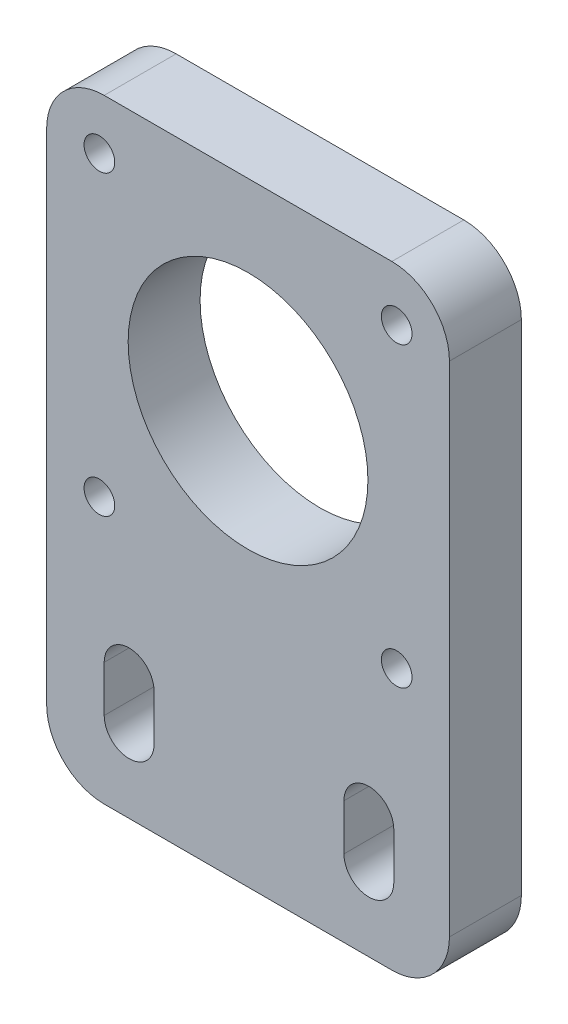
ISO-10303-21;
HEADER;
FILE_DESCRIPTION(('STEP AP214'),'2;1');
FILE_NAME('part.step','',(''),(''),'','','');
FILE_SCHEMA(('AUTOMOTIVE_DESIGN { 1 0 10303 214 1 1 1 1 }'));
ENDSEC;
DATA;
#1=APPLICATION_CONTEXT('core data for automotive mechanical design processes');
#2=APPLICATION_PROTOCOL_DEFINITION('international standard','automotive_design',2000,#1);
#3=PRODUCT_CONTEXT('',#1,'mechanical');
#4=PRODUCT('Part','Part','',(#3));
#5=PRODUCT_RELATED_PRODUCT_CATEGORY('part','',(#4));
#6=PRODUCT_DEFINITION_FORMATION('','',#4);
#7=PRODUCT_DEFINITION_CONTEXT('part definition',#1,'design');
#8=PRODUCT_DEFINITION('design','',#6,#7);
#9=PRODUCT_DEFINITION_SHAPE('','',#8);
#10=(LENGTH_UNIT() NAMED_UNIT(*) SI_UNIT(.MILLI.,.METRE.));
#11=(NAMED_UNIT(*) PLANE_ANGLE_UNIT() SI_UNIT($,.RADIAN.));
#12=(NAMED_UNIT(*) SI_UNIT($,.STERADIAN.) SOLID_ANGLE_UNIT());
#13=UNCERTAINTY_MEASURE_WITH_UNIT(LENGTH_MEASURE(1.E-05),#10,'distance_accuracy_value','');
#14=(GEOMETRIC_REPRESENTATION_CONTEXT(3) GLOBAL_UNCERTAINTY_ASSIGNED_CONTEXT((#13)) GLOBAL_UNIT_ASSIGNED_CONTEXT((#10,
#11,#12)) REPRESENTATION_CONTEXT('',''));
#15=CARTESIAN_POINT('',(0.,0.,0.));
#16=DIRECTION('',(0.,0.,1.));
#17=DIRECTION('',(1.,0.,0.));
#18=AXIS2_PLACEMENT_3D('',#15,#16,#17);
#19=CARTESIAN_POINT('',(-11.5945945945946,-19.4054054054054,-7.5));
#20=DIRECTION('',(0.,0.,1.));
#21=DIRECTION('',(1.,0.,0.));
#22=AXIS2_PLACEMENT_3D('',#19,#20,#21);
#23=CYLINDRICAL_SURFACE('',#22,6.);
#24=CARTESIAN_POINT('',(-11.5945945945946,-19.4054054054054,0.));
#25=DIRECTION('',(0.,0.,1.));
#26=DIRECTION('',(1.,0.,0.));
#27=AXIS2_PLACEMENT_3D('',#24,#25,#26);
#28=CIRCLE('',#27,6.);
#29=CARTESIAN_POINT('',(-17.5945945945946,-19.4054054054054,0.));
#30=VERTEX_POINT('',#29);
#31=CARTESIAN_POINT('',(-11.5945945945946,-25.4054054054054,0.));
#32=VERTEX_POINT('',#31);
#33=EDGE_CURVE('E242',#30,#32,#28,.T.);
#34=ORIENTED_EDGE('',*,*,#33,.F.);
#35=DIRECTION('',(0.,0.,1.));
#36=VECTOR('',#35,1.);
#37=CARTESIAN_POINT('',(-17.5945945945946,-19.4054054054054,-7.5));
#38=LINE('',#37,#36);
#39=CARTESIAN_POINT('',(-17.5945945945946,-19.4054054054054,-7.5));
#40=VERTEX_POINT('',#39);
#41=EDGE_CURVE('E11',#40,#30,#38,.T.);
#42=ORIENTED_EDGE('',*,*,#41,.F.);
#43=CARTESIAN_POINT('',(-11.5945945945946,-19.4054054054054,-7.5));
#44=DIRECTION('',(0.,0.,1.));
#45=DIRECTION('',(1.,0.,0.));
#46=AXIS2_PLACEMENT_3D('',#43,#44,#45);
#47=CIRCLE('',#46,6.);
#48=CARTESIAN_POINT('',(-11.5945945945946,-25.4054054054054,-7.5));
#49=VERTEX_POINT('',#48);
#50=EDGE_CURVE('E245',#40,#49,#47,.T.);
#51=ORIENTED_EDGE('',*,*,#50,.T.);
#52=DIRECTION('',(0.,0.,1.));
#53=VECTOR('',#52,1.);
#54=CARTESIAN_POINT('',(-11.5945945945946,-25.4054054054054,-7.5));
#55=LINE('',#54,#53);
#56=EDGE_CURVE('E36',#49,#32,#55,.T.);
#57=ORIENTED_EDGE('',*,*,#56,.T.);
#58=EDGE_LOOP('',(#34,#42,#51,#57));
#59=FACE_BOUND('',#58,.T.);
#60=ADVANCED_FACE('F33',(#59),#23,.T.);
#61=CARTESIAN_POINT('',(-17.5945945945946,32.5945945945946,-7.5));
#62=DIRECTION('',(-1.,0.,0.));
#63=DIRECTION('',(0.,0.,1.));
#64=AXIS2_PLACEMENT_3D('',#61,#62,#63);
#65=PLANE('',#64);
#66=DIRECTION('',(0.,-1.,0.));
#67=VECTOR('',#66,1.);
#68=CARTESIAN_POINT('',(-17.5945945945946,32.5945945945946,0.));
#69=LINE('',#68,#67);
#70=CARTESIAN_POINT('',(-17.5945945945946,32.5945945945946,0.));
#71=VERTEX_POINT('',#70);
#72=EDGE_CURVE('E249',#71,#30,#69,.T.);
#73=ORIENTED_EDGE('',*,*,#72,.F.);
#74=DIRECTION('',(0.,0.,1.));
#75=VECTOR('',#74,1.);
#76=CARTESIAN_POINT('',(-17.5945945945946,32.5945945945946,-7.5));
#77=LINE('',#76,#75);
#78=CARTESIAN_POINT('',(-17.5945945945946,32.5945945945946,-7.5));
#79=VERTEX_POINT('',#78);
#80=EDGE_CURVE('E41',#79,#71,#77,.T.);
#81=ORIENTED_EDGE('',*,*,#80,.F.);
#82=DIRECTION('',(0.,-1.,0.));
#83=VECTOR('',#82,1.);
#84=CARTESIAN_POINT('',(-17.5945945945946,32.5945945945946,-7.5));
#85=LINE('',#84,#83);
#86=EDGE_CURVE('E267',#79,#40,#85,.T.);
#87=ORIENTED_EDGE('',*,*,#86,.T.);
#88=ORIENTED_EDGE('',*,*,#41,.T.);
#89=EDGE_LOOP('',(#73,#81,#87,#88));
#90=FACE_BOUND('',#89,.T.);
#91=ADVANCED_FACE('F314',(#90),#65,.T.);
#92=CARTESIAN_POINT('',(-11.5945945945946,32.5945945945946,-7.5));
#93=DIRECTION('',(0.,0.,1.));
#94=DIRECTION('',(1.,0.,0.));
#95=AXIS2_PLACEMENT_3D('',#92,#93,#94);
#96=CYLINDRICAL_SURFACE('',#95,6.);
#97=CARTESIAN_POINT('',(-11.5945945945946,32.5945945945946,0.));
#98=DIRECTION('',(0.,0.,1.));
#99=DIRECTION('',(-1.,0.,0.));
#100=AXIS2_PLACEMENT_3D('',#97,#98,#99);
#101=CIRCLE('',#100,6.);
#102=CARTESIAN_POINT('',(-11.5945945945946,38.5945945945946,0.));
#103=VERTEX_POINT('',#102);
#104=EDGE_CURVE('E287',#103,#71,#101,.T.);
#105=ORIENTED_EDGE('',*,*,#104,.F.);
#106=DIRECTION('',(0.,0.,1.));
#107=VECTOR('',#106,1.);
#108=CARTESIAN_POINT('',(-11.5945945945946,38.5945945945946,-7.5));
#109=LINE('',#108,#107);
#110=CARTESIAN_POINT('',(-11.5945945945946,38.5945945945946,-7.5));
#111=VERTEX_POINT('',#110);
#112=EDGE_CURVE('E293',#111,#103,#109,.T.);
#113=ORIENTED_EDGE('',*,*,#112,.F.);
#114=CARTESIAN_POINT('',(-11.5945945945946,32.5945945945946,-7.5));
#115=DIRECTION('',(0.,0.,1.));
#116=DIRECTION('',(-1.,0.,0.));
#117=AXIS2_PLACEMENT_3D('',#114,#115,#116);
#118=CIRCLE('',#117,6.);
#119=EDGE_CURVE('E264',#111,#79,#118,.T.);
#120=ORIENTED_EDGE('',*,*,#119,.T.);
#121=ORIENTED_EDGE('',*,*,#80,.T.);
#122=EDGE_LOOP('',(#105,#113,#120,#121));
#123=FACE_BOUND('',#122,.T.);
#124=ADVANCED_FACE('F334',(#123),#96,.T.);
#125=CARTESIAN_POINT('',(-11.5945945945946,38.5945945945946,-7.5));
#126=DIRECTION('',(0.,1.,0.));
#127=DIRECTION('',(0.,0.,1.));
#128=AXIS2_PLACEMENT_3D('',#125,#126,#127);
#129=PLANE('',#128);
#130=DIRECTION('',(-1.,0.,0.));
#131=VECTOR('',#130,1.);
#132=CARTESIAN_POINT('',(-11.5945945945946,38.5945945945946,0.));
#133=LINE('',#132,#131);
#134=CARTESIAN_POINT('',(18.4054054054053,38.5945945945946,0.));
#135=VERTEX_POINT('',#134);
#136=EDGE_CURVE('E284',#135,#103,#133,.T.);
#137=ORIENTED_EDGE('',*,*,#136,.F.);
#138=DIRECTION('',(0.,0.,1.));
#139=VECTOR('',#138,1.);
#140=CARTESIAN_POINT('',(18.4054054054053,38.5945945945946,-7.5));
#141=LINE('',#140,#139);
#142=CARTESIAN_POINT('',(18.4054054054053,38.5945945945946,-7.5));
#143=VERTEX_POINT('',#142);
#144=EDGE_CURVE('E295',#143,#135,#141,.T.);
#145=ORIENTED_EDGE('',*,*,#144,.F.);
#146=DIRECTION('',(-1.,0.,0.));
#147=VECTOR('',#146,1.);
#148=CARTESIAN_POINT('',(-11.5945945945946,38.5945945945946,-7.5));
#149=LINE('',#148,#147);
#150=EDGE_CURVE('E261',#143,#111,#149,.T.);
#151=ORIENTED_EDGE('',*,*,#150,.T.);
#152=ORIENTED_EDGE('',*,*,#112,.T.);
#153=EDGE_LOOP('',(#137,#145,#151,#152));
#154=FACE_BOUND('',#153,.T.);
#155=ADVANCED_FACE('F332',(#154),#129,.T.);
#156=CARTESIAN_POINT('',(18.4054054054054,32.5945945945946,-7.5));
#157=DIRECTION('',(0.,0.,1.));
#158=DIRECTION('',(1.,0.,0.));
#159=AXIS2_PLACEMENT_3D('',#156,#157,#158);
#160=CYLINDRICAL_SURFACE('',#159,6.);
#161=CARTESIAN_POINT('',(18.4054054054054,32.5945945945946,0.));
#162=DIRECTION('',(0.,0.,1.));
#163=DIRECTION('',(1.,0.,0.));
#164=AXIS2_PLACEMENT_3D('',#161,#162,#163);
#165=CIRCLE('',#164,6.);
#166=CARTESIAN_POINT('',(24.4054054054054,32.5945945945946,0.));
#167=VERTEX_POINT('',#166);
#168=EDGE_CURVE('E281',#167,#135,#165,.T.);
#169=ORIENTED_EDGE('',*,*,#168,.F.);
#170=DIRECTION('',(0.,0.,1.));
#171=VECTOR('',#170,1.);
#172=CARTESIAN_POINT('',(24.4054054054054,32.5945945945946,-7.5));
#173=LINE('',#172,#171);
#174=CARTESIAN_POINT('',(24.4054054054054,32.5945945945946,-7.5));
#175=VERTEX_POINT('',#174);
#176=EDGE_CURVE('E297',#175,#167,#173,.T.);
#177=ORIENTED_EDGE('',*,*,#176,.F.);
#178=CARTESIAN_POINT('',(18.4054054054054,32.5945945945946,-7.5));
#179=DIRECTION('',(0.,0.,1.));
#180=DIRECTION('',(1.,0.,0.));
#181=AXIS2_PLACEMENT_3D('',#178,#179,#180);
#182=CIRCLE('',#181,6.);
#183=EDGE_CURVE('E258',#175,#143,#182,.T.);
#184=ORIENTED_EDGE('',*,*,#183,.T.);
#185=ORIENTED_EDGE('',*,*,#144,.T.);
#186=EDGE_LOOP('',(#169,#177,#184,#185));
#187=FACE_BOUND('',#186,.T.);
#188=ADVANCED_FACE('F328',(#187),#160,.T.);
#189=CARTESIAN_POINT('',(24.4054054054054,32.5945945945946,-7.5));
#190=DIRECTION('',(1.,0.,0.));
#191=DIRECTION('',(0.,1.,0.));
#192=AXIS2_PLACEMENT_3D('',#189,#190,#191);
#193=PLANE('',#192);
#194=DIRECTION('',(0.,1.,0.));
#195=VECTOR('',#194,1.);
#196=CARTESIAN_POINT('',(24.4054054054054,32.5945945945946,0.));
#197=LINE('',#196,#195);
#198=CARTESIAN_POINT('',(24.4054054054054,-19.4054054054054,0.));
#199=VERTEX_POINT('',#198);
#200=EDGE_CURVE('E278',#199,#167,#197,.T.);
#201=ORIENTED_EDGE('',*,*,#200,.F.);
#202=DIRECTION('',(0.,0.,1.));
#203=VECTOR('',#202,1.);
#204=CARTESIAN_POINT('',(24.4054054054054,-19.4054054054054,-7.5));
#205=LINE('',#204,#203);
#206=CARTESIAN_POINT('',(24.4054054054054,-19.4054054054054,-7.5));
#207=VERTEX_POINT('',#206);
#208=EDGE_CURVE('E299',#207,#199,#205,.T.);
#209=ORIENTED_EDGE('',*,*,#208,.F.);
#210=DIRECTION('',(0.,1.,0.));
#211=VECTOR('',#210,1.);
#212=CARTESIAN_POINT('',(24.4054054054054,32.5945945945946,-7.5));
#213=LINE('',#212,#211);
#214=EDGE_CURVE('E255',#207,#175,#213,.T.);
#215=ORIENTED_EDGE('',*,*,#214,.T.);
#216=ORIENTED_EDGE('',*,*,#176,.T.);
#217=EDGE_LOOP('',(#201,#209,#215,#216));
#218=FACE_BOUND('',#217,.T.);
#219=ADVANCED_FACE('F326',(#218),#193,.T.);
#220=CARTESIAN_POINT('',(18.4054054054054,-19.4054054054054,-7.5));
#221=DIRECTION('',(0.,0.,1.));
#222=DIRECTION('',(1.,0.,0.));
#223=AXIS2_PLACEMENT_3D('',#220,#221,#222);
#224=CYLINDRICAL_SURFACE('',#223,6.);
#225=CARTESIAN_POINT('',(18.4054054054054,-19.4054054054054,0.));
#226=DIRECTION('',(0.,0.,1.));
#227=DIRECTION('',(1.,0.,0.));
#228=AXIS2_PLACEMENT_3D('',#225,#226,#227);
#229=CIRCLE('',#228,6.);
#230=CARTESIAN_POINT('',(18.4054054054054,-25.4054054054054,0.));
#231=VERTEX_POINT('',#230);
#232=EDGE_CURVE('E275',#231,#199,#229,.T.);
#233=ORIENTED_EDGE('',*,*,#232,.F.);
#234=DIRECTION('',(0.,0.,1.));
#235=VECTOR('',#234,1.);
#236=CARTESIAN_POINT('',(18.4054054054054,-25.4054054054054,-7.5));
#237=LINE('',#236,#235);
#238=CARTESIAN_POINT('',(18.4054054054054,-25.4054054054054,-7.5));
#239=VERTEX_POINT('',#238);
#240=EDGE_CURVE('E300',#239,#231,#237,.T.);
#241=ORIENTED_EDGE('',*,*,#240,.F.);
#242=CARTESIAN_POINT('',(18.4054054054054,-19.4054054054054,-7.5));
#243=DIRECTION('',(0.,0.,1.));
#244=DIRECTION('',(1.,0.,0.));
#245=AXIS2_PLACEMENT_3D('',#242,#243,#244);
#246=CIRCLE('',#245,6.);
#247=EDGE_CURVE('E252',#239,#207,#246,.T.);
#248=ORIENTED_EDGE('',*,*,#247,.T.);
#249=ORIENTED_EDGE('',*,*,#208,.T.);
#250=EDGE_LOOP('',(#233,#241,#248,#249));
#251=FACE_BOUND('',#250,.T.);
#252=ADVANCED_FACE('F322',(#251),#224,.T.);
#253=CARTESIAN_POINT('',(-11.5945945945946,-25.4054054054054,-7.5));
#254=DIRECTION('',(0.,-1.,0.));
#255=DIRECTION('',(0.,0.,-1.));
#256=AXIS2_PLACEMENT_3D('',#253,#254,#255);
#257=PLANE('',#256);
#258=DIRECTION('',(1.,0.,0.));
#259=VECTOR('',#258,1.);
#260=CARTESIAN_POINT('',(-11.5945945945946,-25.4054054054054,0.));
#261=LINE('',#260,#259);
#262=EDGE_CURVE('E272',#32,#231,#261,.T.);
#263=ORIENTED_EDGE('',*,*,#262,.F.);
#264=ORIENTED_EDGE('',*,*,#56,.F.);
#265=DIRECTION('',(1.,0.,0.));
#266=VECTOR('',#265,1.);
#267=CARTESIAN_POINT('',(-11.5945945945946,-25.4054054054054,-7.5));
#268=LINE('',#267,#266);
#269=EDGE_CURVE('E248',#49,#239,#268,.T.);
#270=ORIENTED_EDGE('',*,*,#269,.T.);
#271=ORIENTED_EDGE('',*,*,#240,.T.);
#272=EDGE_LOOP('',(#263,#264,#270,#271));
#273=FACE_BOUND('',#272,.T.);
#274=ADVANCED_FACE('F308',(#273),#257,.T.);
#275=CARTESIAN_POINT('',(-11.5945945945946,-19.4054054054054,-7.5));
#276=DIRECTION('',(0.,0.,1.));
#277=DIRECTION('',(1.,0.,0.));
#278=AXIS2_PLACEMENT_3D('',#275,#276,#277);
#279=PLANE('',#278);
#280=DIRECTION('',(0.,1.,0.));
#281=VECTOR('',#280,1.);
#282=CARTESIAN_POINT('',(-6.39459459459461,-12.6054054054054,-7.5));
#283=LINE('',#282,#281);
#284=CARTESIAN_POINT('',(-6.39459459459461,-17.40540541,-7.5));
#285=VERTEX_POINT('',#284);
#286=CARTESIAN_POINT('',(-6.39459459459461,-12.6054054054054,-7.5));
#287=VERTEX_POINT('',#286);
#288=EDGE_CURVE('E154',#285,#287,#283,.T.);
#289=ORIENTED_EDGE('',*,*,#288,.T.);
#290=CARTESIAN_POINT('',(-8.99459459459461,-12.6054054054054,-7.5));
#291=DIRECTION('',(0.,0.,1.));
#292=DIRECTION('',(1.,0.,0.));
#293=AXIS2_PLACEMENT_3D('',#290,#291,#292);
#294=CIRCLE('',#293,2.6);
#295=CARTESIAN_POINT('',(-11.5945945945946,-12.6054054054054,-7.5));
#296=VERTEX_POINT('',#295);
#297=EDGE_CURVE('E148',#287,#296,#294,.T.);
#298=ORIENTED_EDGE('',*,*,#297,.T.);
#299=DIRECTION('',(0.,-1.,0.));
#300=VECTOR('',#299,1.);
#301=CARTESIAN_POINT('',(-11.5945945945946,-12.6054054054054,-7.5));
#302=LINE('',#301,#300);
#303=CARTESIAN_POINT('',(-11.5945945945946,-17.40540541,-7.5));
#304=VERTEX_POINT('',#303);
#305=EDGE_CURVE('E157',#296,#304,#302,.T.);
#306=ORIENTED_EDGE('',*,*,#305,.T.);
#307=CARTESIAN_POINT('',(-8.99459459459461,-17.40540541,-7.5));
#308=DIRECTION('',(0.,0.,1.));
#309=DIRECTION('',(1.,0.,0.));
#310=AXIS2_PLACEMENT_3D('',#307,#308,#309);
#311=CIRCLE('',#310,2.6);
#312=EDGE_CURVE('E49',#304,#285,#311,.T.);
#313=ORIENTED_EDGE('',*,*,#312,.T.);
#314=EDGE_LOOP('',(#289,#298,#306,#313));
#315=FACE_BOUND('',#314,.T.);
#316=DIRECTION('',(0.,1.,0.));
#317=VECTOR('',#316,1.);
#318=CARTESIAN_POINT('',(18.6054054054054,-12.6054054054054,-7.5));
#319=LINE('',#318,#317);
#320=CARTESIAN_POINT('',(18.6054054054054,-17.40540541,-7.5));
#321=VERTEX_POINT('',#320);
#322=CARTESIAN_POINT('',(18.6054054054054,-12.6054054054054,-7.5));
#323=VERTEX_POINT('',#322);
#324=EDGE_CURVE('E193',#321,#323,#319,.T.);
#325=ORIENTED_EDGE('',*,*,#324,.T.);
#326=CARTESIAN_POINT('',(16.0054054054054,-12.6054054054054,-7.5));
#327=DIRECTION('',(0.,0.,1.));
#328=DIRECTION('',(1.,0.,0.));
#329=AXIS2_PLACEMENT_3D('',#326,#327,#328);
#330=CIRCLE('',#329,2.6);
#331=CARTESIAN_POINT('',(13.4054054054054,-12.6054054054054,-7.5));
#332=VERTEX_POINT('',#331);
#333=EDGE_CURVE('E183',#323,#332,#330,.T.);
#334=ORIENTED_EDGE('',*,*,#333,.T.);
#335=DIRECTION('',(0.,-1.,0.));
#336=VECTOR('',#335,1.);
#337=CARTESIAN_POINT('',(13.4054054054054,-12.6054054054054,-7.5));
#338=LINE('',#337,#336);
#339=CARTESIAN_POINT('',(13.4054054054054,-17.40540541,-7.5));
#340=VERTEX_POINT('',#339);
#341=EDGE_CURVE('E186',#332,#340,#338,.T.);
#342=ORIENTED_EDGE('',*,*,#341,.T.);
#343=CARTESIAN_POINT('',(16.0054054054054,-17.40540541,-7.5));
#344=DIRECTION('',(0.,0.,1.));
#345=DIRECTION('',(1.,0.,0.));
#346=AXIS2_PLACEMENT_3D('',#343,#344,#345);
#347=CIRCLE('',#346,2.6);
#348=EDGE_CURVE('E190',#340,#321,#347,.T.);
#349=ORIENTED_EDGE('',*,*,#348,.T.);
#350=EDGE_LOOP('',(#325,#334,#342,#349));
#351=FACE_BOUND('',#350,.T.);
#352=CARTESIAN_POINT('',(-12.0945945945946,2.09459459459461,-7.5));
#353=DIRECTION('',(0.,0.,1.));
#354=DIRECTION('',(1.,0.,0.));
#355=AXIS2_PLACEMENT_3D('',#352,#353,#354);
#356=CIRCLE('',#355,1.6);
#357=CARTESIAN_POINT('',(-10.4945945945946,2.09459459459461,-7.5));
#358=VERTEX_POINT('',#357);
#359=EDGE_CURVE('E215',#358,#358,#356,.T.);
#360=ORIENTED_EDGE('',*,*,#359,.T.);
#361=EDGE_LOOP('',(#360));
#362=FACE_BOUND('',#361,.T.);
#363=CARTESIAN_POINT('',(18.9054054054054,2.09459459459461,-7.5));
#364=DIRECTION('',(0.,0.,1.));
#365=DIRECTION('',(1.,0.,0.));
#366=AXIS2_PLACEMENT_3D('',#363,#364,#365);
#367=CIRCLE('',#366,1.6);
#368=CARTESIAN_POINT('',(20.5054054054054,2.09459459459461,-7.5));
#369=VERTEX_POINT('',#368);
#370=EDGE_CURVE('E221',#369,#369,#367,.T.);
#371=ORIENTED_EDGE('',*,*,#370,.T.);
#372=EDGE_LOOP('',(#371));
#373=FACE_BOUND('',#372,.T.);
#374=CARTESIAN_POINT('',(18.9054054054054,33.0945945945946,-7.5));
#375=DIRECTION('',(0.,0.,1.));
#376=DIRECTION('',(1.,0.,0.));
#377=AXIS2_PLACEMENT_3D('',#374,#375,#376);
#378=CIRCLE('',#377,1.6);
#379=CARTESIAN_POINT('',(20.5054054054054,33.0945945945946,-7.5));
#380=VERTEX_POINT('',#379);
#381=EDGE_CURVE('E227',#380,#380,#378,.T.);
#382=ORIENTED_EDGE('',*,*,#381,.T.);
#383=EDGE_LOOP('',(#382));
#384=FACE_BOUND('',#383,.T.);
#385=CARTESIAN_POINT('',(-12.0945945945946,33.0945945945946,-7.5));
#386=DIRECTION('',(0.,0.,1.));
#387=DIRECTION('',(1.,0.,0.));
#388=AXIS2_PLACEMENT_3D('',#385,#386,#387);
#389=CIRCLE('',#388,1.6);
#390=CARTESIAN_POINT('',(-10.4945945945946,33.0945945945946,-7.5));
#391=VERTEX_POINT('',#390);
#392=EDGE_CURVE('E233',#391,#391,#389,.T.);
#393=ORIENTED_EDGE('',*,*,#392,.T.);
#394=EDGE_LOOP('',(#393));
#395=FACE_BOUND('',#394,.T.);
#396=CARTESIAN_POINT('',(3.40540540540538,17.5945945945946,-7.5));
#397=DIRECTION('',(0.,0.,1.));
#398=DIRECTION('',(1.,0.,0.));
#399=AXIS2_PLACEMENT_3D('',#396,#397,#398);
#400=CIRCLE('',#399,12.5);
#401=CARTESIAN_POINT('',(15.9054054054054,17.5945945945946,-7.5));
#402=VERTEX_POINT('',#401);
#403=EDGE_CURVE('E239',#402,#402,#400,.T.);
#404=ORIENTED_EDGE('',*,*,#403,.T.);
#405=EDGE_LOOP('',(#404));
#406=FACE_BOUND('',#405,.T.);
#407=ORIENTED_EDGE('',*,*,#50,.F.);
#408=ORIENTED_EDGE('',*,*,#86,.F.);
#409=ORIENTED_EDGE('',*,*,#119,.F.);
#410=ORIENTED_EDGE('',*,*,#150,.F.);
#411=ORIENTED_EDGE('',*,*,#183,.F.);
#412=ORIENTED_EDGE('',*,*,#214,.F.);
#413=ORIENTED_EDGE('',*,*,#247,.F.);
#414=ORIENTED_EDGE('',*,*,#269,.F.);
#415=EDGE_LOOP('',(#407,#408,#409,#410,#411,#412,#413,#414));
#416=FACE_BOUND('',#415,.T.);
#417=ADVANCED_FACE('F161',(#315,#351,#362,#373,#384,#395,#406,#416),#279,.F.);
#418=CARTESIAN_POINT('',(-11.5945945945946,-19.4054054054054,0.));
#419=DIRECTION('',(0.,0.,1.));
#420=DIRECTION('',(1.,0.,0.));
#421=AXIS2_PLACEMENT_3D('',#418,#419,#420);
#422=PLANE('',#421);
#423=CARTESIAN_POINT('',(-8.99459459459461,-12.6054054054054,0.));
#424=DIRECTION('',(0.,0.,1.));
#425=DIRECTION('',(1.,0.,0.));
#426=AXIS2_PLACEMENT_3D('',#423,#424,#425);
#427=CIRCLE('',#426,2.6);
#428=CARTESIAN_POINT('',(-6.39459459459461,-12.6054054054054,0.));
#429=VERTEX_POINT('',#428);
#430=CARTESIAN_POINT('',(-11.5945945945946,-12.6054054054054,0.));
#431=VERTEX_POINT('',#430);
#432=EDGE_CURVE('E57',#429,#431,#427,.T.);
#433=ORIENTED_EDGE('',*,*,#432,.F.);
#434=DIRECTION('',(0.,1.,0.));
#435=VECTOR('',#434,1.);
#436=CARTESIAN_POINT('',(-6.39459459459461,-12.6054054054054,0.));
#437=LINE('',#436,#435);
#438=CARTESIAN_POINT('',(-6.39459459459461,-17.40540541,0.));
#439=VERTEX_POINT('',#438);
#440=EDGE_CURVE('E164',#439,#429,#437,.T.);
#441=ORIENTED_EDGE('',*,*,#440,.F.);
#442=CARTESIAN_POINT('',(-8.99459459459461,-17.40540541,0.));
#443=DIRECTION('',(0.,0.,1.));
#444=DIRECTION('',(1.,0.,0.));
#445=AXIS2_PLACEMENT_3D('',#442,#443,#444);
#446=CIRCLE('',#445,2.6);
#447=CARTESIAN_POINT('',(-11.5945945945946,-17.40540541,0.));
#448=VERTEX_POINT('',#447);
#449=EDGE_CURVE('E167',#448,#439,#446,.T.);
#450=ORIENTED_EDGE('',*,*,#449,.F.);
#451=DIRECTION('',(0.,-1.,0.));
#452=VECTOR('',#451,1.);
#453=CARTESIAN_POINT('',(-11.5945945945946,-12.6054054054054,0.));
#454=LINE('',#453,#452);
#455=EDGE_CURVE('E173',#431,#448,#454,.T.);
#456=ORIENTED_EDGE('',*,*,#455,.F.);
#457=EDGE_LOOP('',(#433,#441,#450,#456));
#458=FACE_BOUND('',#457,.T.);
#459=CARTESIAN_POINT('',(16.0054054054054,-12.6054054054054,0.));
#460=DIRECTION('',(0.,0.,1.));
#461=DIRECTION('',(1.,0.,0.));
#462=AXIS2_PLACEMENT_3D('',#459,#460,#461);
#463=CIRCLE('',#462,2.6);
#464=CARTESIAN_POINT('',(18.6054054054054,-12.6054054054054,0.));
#465=VERTEX_POINT('',#464);
#466=CARTESIAN_POINT('',(13.4054054054054,-12.6054054054054,0.));
#467=VERTEX_POINT('',#466);
#468=EDGE_CURVE('E179',#465,#467,#463,.T.);
#469=ORIENTED_EDGE('',*,*,#468,.F.);
#470=DIRECTION('',(0.,1.,0.));
#471=VECTOR('',#470,1.);
#472=CARTESIAN_POINT('',(18.6054054054054,-12.6054054054054,0.));
#473=LINE('',#472,#471);
#474=CARTESIAN_POINT('',(18.6054054054054,-17.40540541,0.));
#475=VERTEX_POINT('',#474);
#476=EDGE_CURVE('E187',#475,#465,#473,.T.);
#477=ORIENTED_EDGE('',*,*,#476,.F.);
#478=CARTESIAN_POINT('',(16.0054054054054,-17.40540541,0.));
#479=DIRECTION('',(0.,0.,1.));
#480=DIRECTION('',(1.,0.,0.));
#481=AXIS2_PLACEMENT_3D('',#478,#479,#480);
#482=CIRCLE('',#481,2.6);
#483=CARTESIAN_POINT('',(13.4054054054054,-17.40540541,0.));
#484=VERTEX_POINT('',#483);
#485=EDGE_CURVE('E201',#484,#475,#482,.T.);
#486=ORIENTED_EDGE('',*,*,#485,.F.);
#487=DIRECTION('',(0.,-1.,0.));
#488=VECTOR('',#487,1.);
#489=CARTESIAN_POINT('',(13.4054054054054,-12.6054054054054,0.));
#490=LINE('',#489,#488);
#491=EDGE_CURVE('E198',#467,#484,#490,.T.);
#492=ORIENTED_EDGE('',*,*,#491,.F.);
#493=EDGE_LOOP('',(#469,#477,#486,#492));
#494=FACE_BOUND('',#493,.T.);
#495=CARTESIAN_POINT('',(-12.0945945945946,2.09459459459461,0.));
#496=DIRECTION('',(0.,0.,1.));
#497=DIRECTION('',(1.,0.,0.));
#498=AXIS2_PLACEMENT_3D('',#495,#496,#497);
#499=CIRCLE('',#498,1.6);
#500=CARTESIAN_POINT('',(-10.4945945945946,2.09459459459461,0.));
#501=VERTEX_POINT('',#500);
#502=EDGE_CURVE('E208',#501,#501,#499,.T.);
#503=ORIENTED_EDGE('',*,*,#502,.F.);
#504=EDGE_LOOP('',(#503));
#505=FACE_BOUND('',#504,.T.);
#506=CARTESIAN_POINT('',(18.9054054054054,2.09459459459461,0.));
#507=DIRECTION('',(0.,0.,1.));
#508=DIRECTION('',(1.,0.,0.));
#509=AXIS2_PLACEMENT_3D('',#506,#507,#508);
#510=CIRCLE('',#509,1.6);
#511=CARTESIAN_POINT('',(20.5054054054054,2.09459459459461,0.));
#512=VERTEX_POINT('',#511);
#513=EDGE_CURVE('E218',#512,#512,#510,.T.);
#514=ORIENTED_EDGE('',*,*,#513,.F.);
#515=EDGE_LOOP('',(#514));
#516=FACE_BOUND('',#515,.T.);
#517=CARTESIAN_POINT('',(18.9054054054054,33.0945945945946,0.));
#518=DIRECTION('',(0.,0.,1.));
#519=DIRECTION('',(1.,0.,0.));
#520=AXIS2_PLACEMENT_3D('',#517,#518,#519);
#521=CIRCLE('',#520,1.6);
#522=CARTESIAN_POINT('',(20.5054054054054,33.0945945945946,0.));
#523=VERTEX_POINT('',#522);
#524=EDGE_CURVE('E224',#523,#523,#521,.T.);
#525=ORIENTED_EDGE('',*,*,#524,.F.);
#526=EDGE_LOOP('',(#525));
#527=FACE_BOUND('',#526,.T.);
#528=CARTESIAN_POINT('',(-12.0945945945946,33.0945945945946,0.));
#529=DIRECTION('',(0.,0.,1.));
#530=DIRECTION('',(1.,0.,0.));
#531=AXIS2_PLACEMENT_3D('',#528,#529,#530);
#532=CIRCLE('',#531,1.6);
#533=CARTESIAN_POINT('',(-10.4945945945946,33.0945945945946,0.));
#534=VERTEX_POINT('',#533);
#535=EDGE_CURVE('E230',#534,#534,#532,.T.);
#536=ORIENTED_EDGE('',*,*,#535,.F.);
#537=EDGE_LOOP('',(#536));
#538=FACE_BOUND('',#537,.T.);
#539=CARTESIAN_POINT('',(3.40540540540538,17.5945945945946,0.));
#540=DIRECTION('',(0.,0.,1.));
#541=DIRECTION('',(1.,0.,0.));
#542=AXIS2_PLACEMENT_3D('',#539,#540,#541);
#543=CIRCLE('',#542,12.5);
#544=CARTESIAN_POINT('',(15.9054054054054,17.5945945945946,0.));
#545=VERTEX_POINT('',#544);
#546=EDGE_CURVE('E236',#545,#545,#543,.T.);
#547=ORIENTED_EDGE('',*,*,#546,.F.);
#548=EDGE_LOOP('',(#547));
#549=FACE_BOUND('',#548,.T.);
#550=ORIENTED_EDGE('',*,*,#33,.T.);
#551=ORIENTED_EDGE('',*,*,#262,.T.);
#552=ORIENTED_EDGE('',*,*,#232,.T.);
#553=ORIENTED_EDGE('',*,*,#200,.T.);
#554=ORIENTED_EDGE('',*,*,#168,.T.);
#555=ORIENTED_EDGE('',*,*,#136,.T.);
#556=ORIENTED_EDGE('',*,*,#104,.T.);
#557=ORIENTED_EDGE('',*,*,#72,.T.);
#558=EDGE_LOOP('',(#550,#551,#552,#553,#554,#555,#556,#557));
#559=FACE_BOUND('',#558,.T.);
#560=ADVANCED_FACE('F310',(#458,#494,#505,#516,#527,#538,#549,#559),#422,.T.);
#561=CARTESIAN_POINT('',(3.40540540540538,17.5945945945946,-7.5));
#562=DIRECTION('',(0.,0.,1.));
#563=DIRECTION('',(1.,0.,0.));
#564=AXIS2_PLACEMENT_3D('',#561,#562,#563);
#565=CYLINDRICAL_SURFACE('',#564,12.5);
#566=ORIENTED_EDGE('',*,*,#403,.F.);
#567=EDGE_LOOP('',(#566));
#568=FACE_BOUND('',#567,.T.);
#569=ORIENTED_EDGE('',*,*,#546,.T.);
#570=EDGE_LOOP('',(#569));
#571=FACE_BOUND('',#570,.T.);
#572=ADVANCED_FACE('F408',(#568,#571),#565,.F.);
#573=CARTESIAN_POINT('',(-12.0945945945946,33.0945945945946,-7.5));
#574=DIRECTION('',(0.,0.,1.));
#575=DIRECTION('',(1.,0.,0.));
#576=AXIS2_PLACEMENT_3D('',#573,#574,#575);
#577=CYLINDRICAL_SURFACE('',#576,1.6);
#578=ORIENTED_EDGE('',*,*,#392,.F.);
#579=EDGE_LOOP('',(#578));
#580=FACE_BOUND('',#579,.T.);
#581=ORIENTED_EDGE('',*,*,#535,.T.);
#582=EDGE_LOOP('',(#581));
#583=FACE_BOUND('',#582,.T.);
#584=ADVANCED_FACE('F418',(#580,#583),#577,.F.);
#585=CARTESIAN_POINT('',(18.9054054054054,33.0945945945946,-7.5));
#586=DIRECTION('',(0.,0.,1.));
#587=DIRECTION('',(1.,0.,0.));
#588=AXIS2_PLACEMENT_3D('',#585,#586,#587);
#589=CYLINDRICAL_SURFACE('',#588,1.6);
#590=ORIENTED_EDGE('',*,*,#381,.F.);
#591=EDGE_LOOP('',(#590));
#592=FACE_BOUND('',#591,.T.);
#593=ORIENTED_EDGE('',*,*,#524,.T.);
#594=EDGE_LOOP('',(#593));
#595=FACE_BOUND('',#594,.T.);
#596=ADVANCED_FACE('F428',(#592,#595),#589,.F.);
#597=CARTESIAN_POINT('',(18.9054054054054,2.09459459459461,-7.5));
#598=DIRECTION('',(0.,0.,1.));
#599=DIRECTION('',(1.,0.,0.));
#600=AXIS2_PLACEMENT_3D('',#597,#598,#599);
#601=CYLINDRICAL_SURFACE('',#600,1.6);
#602=ORIENTED_EDGE('',*,*,#370,.F.);
#603=EDGE_LOOP('',(#602));
#604=FACE_BOUND('',#603,.T.);
#605=ORIENTED_EDGE('',*,*,#513,.T.);
#606=EDGE_LOOP('',(#605));
#607=FACE_BOUND('',#606,.T.);
#608=ADVANCED_FACE('F438',(#604,#607),#601,.F.);
#609=CARTESIAN_POINT('',(-12.0945945945946,2.09459459459461,-7.5));
#610=DIRECTION('',(0.,0.,1.));
#611=DIRECTION('',(1.,0.,0.));
#612=AXIS2_PLACEMENT_3D('',#609,#610,#611);
#613=CYLINDRICAL_SURFACE('',#612,1.6);
#614=ORIENTED_EDGE('',*,*,#359,.F.);
#615=EDGE_LOOP('',(#614));
#616=FACE_BOUND('',#615,.T.);
#617=ORIENTED_EDGE('',*,*,#502,.T.);
#618=EDGE_LOOP('',(#617));
#619=FACE_BOUND('',#618,.T.);
#620=ADVANCED_FACE('F448',(#616,#619),#613,.F.);
#621=CARTESIAN_POINT('',(16.0054054054054,-12.6054054054054,-7.5));
#622=DIRECTION('',(0.,0.,1.));
#623=DIRECTION('',(1.,0.,0.));
#624=AXIS2_PLACEMENT_3D('',#621,#622,#623);
#625=CYLINDRICAL_SURFACE('',#624,2.6);
#626=ORIENTED_EDGE('',*,*,#468,.T.);
#627=DIRECTION('',(0.,0.,1.));
#628=VECTOR('',#627,1.);
#629=CARTESIAN_POINT('',(13.4054054054054,-12.6054054054054,-7.5));
#630=LINE('',#629,#628);
#631=EDGE_CURVE('E196',#332,#467,#630,.T.);
#632=ORIENTED_EDGE('',*,*,#631,.F.);
#633=ORIENTED_EDGE('',*,*,#333,.F.);
#634=DIRECTION('',(0.,0.,1.));
#635=VECTOR('',#634,1.);
#636=CARTESIAN_POINT('',(18.6054054054054,-12.6054054054054,-7.5));
#637=LINE('',#636,#635);
#638=EDGE_CURVE('E206',#323,#465,#637,.T.);
#639=ORIENTED_EDGE('',*,*,#638,.T.);
#640=EDGE_LOOP('',(#626,#632,#633,#639));
#641=FACE_BOUND('',#640,.T.);
#642=ADVANCED_FACE('F458',(#641),#625,.F.);
#643=CARTESIAN_POINT('',(18.6054054054054,-12.6054054054054,-7.5));
#644=DIRECTION('',(1.,0.,0.));
#645=DIRECTION('',(0.,0.,-1.));
#646=AXIS2_PLACEMENT_3D('',#643,#644,#645);
#647=PLANE('',#646);
#648=ORIENTED_EDGE('',*,*,#476,.T.);
#649=ORIENTED_EDGE('',*,*,#638,.F.);
#650=ORIENTED_EDGE('',*,*,#324,.F.);
#651=DIRECTION('',(0.,0.,1.));
#652=VECTOR('',#651,1.);
#653=CARTESIAN_POINT('',(18.6054054054054,-17.40540541,-7.5));
#654=LINE('',#653,#652);
#655=EDGE_CURVE('E209',#321,#475,#654,.T.);
#656=ORIENTED_EDGE('',*,*,#655,.T.);
#657=EDGE_LOOP('',(#648,#649,#650,#656));
#658=FACE_BOUND('',#657,.T.);
#659=ADVANCED_FACE('F468',(#658),#647,.F.);
#660=CARTESIAN_POINT('',(16.0054054054054,-17.40540541,-7.5));
#661=DIRECTION('',(0.,0.,1.));
#662=DIRECTION('',(1.,0.,0.));
#663=AXIS2_PLACEMENT_3D('',#660,#661,#662);
#664=CYLINDRICAL_SURFACE('',#663,2.6);
#665=ORIENTED_EDGE('',*,*,#485,.T.);
#666=ORIENTED_EDGE('',*,*,#655,.F.);
#667=ORIENTED_EDGE('',*,*,#348,.F.);
#668=DIRECTION('',(0.,0.,1.));
#669=VECTOR('',#668,1.);
#670=CARTESIAN_POINT('',(13.4054054054054,-17.40540541,-7.5));
#671=LINE('',#670,#669);
#672=EDGE_CURVE('E211',#340,#484,#671,.T.);
#673=ORIENTED_EDGE('',*,*,#672,.T.);
#674=EDGE_LOOP('',(#665,#666,#667,#673));
#675=FACE_BOUND('',#674,.T.);
#676=ADVANCED_FACE('F478',(#675),#664,.F.);
#677=CARTESIAN_POINT('',(13.4054054054054,-12.6054054054054,-7.5));
#678=DIRECTION('',(-1.,0.,0.));
#679=DIRECTION('',(0.,0.,1.));
#680=AXIS2_PLACEMENT_3D('',#677,#678,#679);
#681=PLANE('',#680);
#682=ORIENTED_EDGE('',*,*,#491,.T.);
#683=ORIENTED_EDGE('',*,*,#672,.F.);
#684=ORIENTED_EDGE('',*,*,#341,.F.);
#685=ORIENTED_EDGE('',*,*,#631,.T.);
#686=EDGE_LOOP('',(#682,#683,#684,#685));
#687=FACE_BOUND('',#686,.T.);
#688=ADVANCED_FACE('F488',(#687),#681,.F.);
#689=CARTESIAN_POINT('',(-8.99459459459461,-12.6054054054054,-7.5));
#690=DIRECTION('',(0.,0.,1.));
#691=DIRECTION('',(1.,0.,0.));
#692=AXIS2_PLACEMENT_3D('',#689,#690,#691);
#693=CYLINDRICAL_SURFACE('',#692,2.6);
#694=ORIENTED_EDGE('',*,*,#432,.T.);
#695=DIRECTION('',(0.,0.,1.));
#696=VECTOR('',#695,1.);
#697=CARTESIAN_POINT('',(-11.5945945945946,-12.6054054054054,-7.5));
#698=LINE('',#697,#696);
#699=EDGE_CURVE('E144',#296,#431,#698,.T.);
#700=ORIENTED_EDGE('',*,*,#699,.F.);
#701=ORIENTED_EDGE('',*,*,#297,.F.);
#702=DIRECTION('',(0.,0.,1.));
#703=VECTOR('',#702,1.);
#704=CARTESIAN_POINT('',(-6.39459459459461,-12.6054054054054,-7.5));
#705=LINE('',#704,#703);
#706=EDGE_CURVE('E177',#287,#429,#705,.T.);
#707=ORIENTED_EDGE('',*,*,#706,.T.);
#708=EDGE_LOOP('',(#694,#700,#701,#707));
#709=FACE_BOUND('',#708,.T.);
#710=ADVANCED_FACE('F146',(#709),#693,.F.);
#711=CARTESIAN_POINT('',(-6.39459459459461,-12.6054054054054,-7.5));
#712=DIRECTION('',(1.,0.,0.));
#713=DIRECTION('',(0.,0.,-1.));
#714=AXIS2_PLACEMENT_3D('',#711,#712,#713);
#715=PLANE('',#714);
#716=ORIENTED_EDGE('',*,*,#440,.T.);
#717=ORIENTED_EDGE('',*,*,#706,.F.);
#718=ORIENTED_EDGE('',*,*,#288,.F.);
#719=DIRECTION('',(0.,0.,1.));
#720=VECTOR('',#719,1.);
#721=CARTESIAN_POINT('',(-6.39459459459461,-17.40540541,-7.5));
#722=LINE('',#721,#720);
#723=EDGE_CURVE('E180',#285,#439,#722,.T.);
#724=ORIENTED_EDGE('',*,*,#723,.T.);
#725=EDGE_LOOP('',(#716,#717,#718,#724));
#726=FACE_BOUND('',#725,.T.);
#727=ADVANCED_FACE('F507',(#726),#715,.F.);
#728=CARTESIAN_POINT('',(-8.99459459459461,-17.40540541,-7.5));
#729=DIRECTION('',(0.,0.,1.));
#730=DIRECTION('',(1.,0.,0.));
#731=AXIS2_PLACEMENT_3D('',#728,#729,#730);
#732=CYLINDRICAL_SURFACE('',#731,2.6);
#733=ORIENTED_EDGE('',*,*,#449,.T.);
#734=ORIENTED_EDGE('',*,*,#723,.F.);
#735=ORIENTED_EDGE('',*,*,#312,.F.);
#736=DIRECTION('',(0.,0.,1.));
#737=VECTOR('',#736,1.);
#738=CARTESIAN_POINT('',(-11.5945945945946,-17.40540541,-7.5));
#739=LINE('',#738,#737);
#740=EDGE_CURVE('E153',#304,#448,#739,.T.);
#741=ORIENTED_EDGE('',*,*,#740,.T.);
#742=EDGE_LOOP('',(#733,#734,#735,#741));
#743=FACE_BOUND('',#742,.T.);
#744=ADVANCED_FACE('F516',(#743),#732,.F.);
#745=CARTESIAN_POINT('',(-11.5945945945946,-12.6054054054054,-7.5));
#746=DIRECTION('',(-1.,0.,0.));
#747=DIRECTION('',(0.,-1.,0.));
#748=AXIS2_PLACEMENT_3D('',#745,#746,#747);
#749=PLANE('',#748);
#750=ORIENTED_EDGE('',*,*,#455,.T.);
#751=ORIENTED_EDGE('',*,*,#740,.F.);
#752=ORIENTED_EDGE('',*,*,#305,.F.);
#753=ORIENTED_EDGE('',*,*,#699,.T.);
#754=EDGE_LOOP('',(#750,#751,#752,#753));
#755=FACE_BOUND('',#754,.T.);
#756=ADVANCED_FACE('F158',(#755),#749,.F.);
#757=CLOSED_SHELL('',(#60,#91,#124,#155,#188,#219,#252,#274,#417,#560,#572,#584,#596,#608,#620,
#642,#659,#676,#688,#710,#727,#744,#756));
#758=MANIFOLD_SOLID_BREP('B2',#757);
#759=ADVANCED_BREP_SHAPE_REPRESENTATION('',(#18,#758),#14);
#760=SHAPE_DEFINITION_REPRESENTATION(#9,#759);
ENDSEC;
END-ISO-10303-21;
